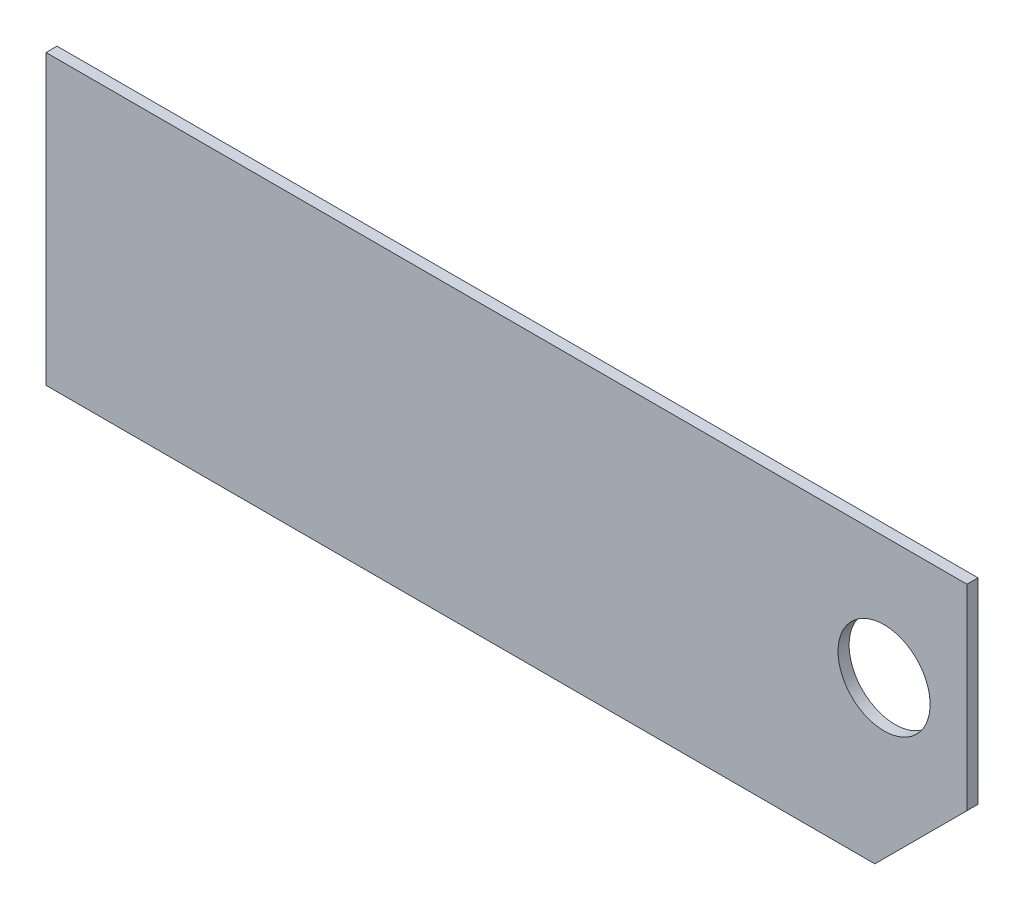
ISO-10303-21;
HEADER;
FILE_DESCRIPTION(('STEP AP214'),'2;1');
FILE_NAME('part.step','',(''),(''),'','','');
FILE_SCHEMA(('AUTOMOTIVE_DESIGN { 1 0 10303 214 1 1 1 1 }'));
ENDSEC;
DATA;
#1=APPLICATION_CONTEXT('core data for automotive mechanical design processes');
#2=APPLICATION_PROTOCOL_DEFINITION('international standard','automotive_design',2000,#1);
#3=PRODUCT_CONTEXT('',#1,'mechanical');
#4=PRODUCT('Part','Part','',(#3));
#5=PRODUCT_RELATED_PRODUCT_CATEGORY('part','',(#4));
#6=PRODUCT_DEFINITION_FORMATION('','',#4);
#7=PRODUCT_DEFINITION_CONTEXT('part definition',#1,'design');
#8=PRODUCT_DEFINITION('design','',#6,#7);
#9=PRODUCT_DEFINITION_SHAPE('','',#8);
#10=(LENGTH_UNIT() NAMED_UNIT(*) SI_UNIT(.MILLI.,.METRE.));
#11=(NAMED_UNIT(*) PLANE_ANGLE_UNIT() SI_UNIT($,.RADIAN.));
#12=(NAMED_UNIT(*) SI_UNIT($,.STERADIAN.) SOLID_ANGLE_UNIT());
#13=UNCERTAINTY_MEASURE_WITH_UNIT(LENGTH_MEASURE(1.E-05),#10,'distance_accuracy_value','');
#14=(GEOMETRIC_REPRESENTATION_CONTEXT(3) GLOBAL_UNCERTAINTY_ASSIGNED_CONTEXT((#13)) GLOBAL_UNIT_ASSIGNED_CONTEXT((#10,
#11,#12)) REPRESENTATION_CONTEXT('',''));
#15=CARTESIAN_POINT('',(0.,0.,0.));
#16=DIRECTION('',(0.,0.,1.));
#17=DIRECTION('',(1.,0.,0.));
#18=AXIS2_PLACEMENT_3D('',#15,#16,#17);
#19=CARTESIAN_POINT('',(-139.812818371494,47.1171062326941,0.75));
#20=DIRECTION('',(-1.,0.,0.));
#21=DIRECTION('',(0.,0.,1.));
#22=AXIS2_PLACEMENT_3D('',#19,#20,#21);
#23=PLANE('',#22);
#24=DIRECTION('',(0.,-1.,0.));
#25=VECTOR('',#24,1.);
#26=CARTESIAN_POINT('',(-139.812818371494,47.1171062326941,5.25));
#27=LINE('',#26,#25);
#28=CARTESIAN_POINT('',(-139.812818371494,47.1171062326941,5.25));
#29=VERTEX_POINT('',#28);
#30=CARTESIAN_POINT('',(-139.812818371494,-70.2578937673059,5.25));
#31=VERTEX_POINT('',#30);
#32=EDGE_CURVE('E112',#29,#31,#27,.T.);
#33=ORIENTED_EDGE('',*,*,#32,.F.);
#34=DIRECTION('',(0.,0.,1.));
#35=VECTOR('',#34,1.);
#36=CARTESIAN_POINT('',(-139.812818371494,47.1171062326941,0.75));
#37=LINE('',#36,#35);
#38=CARTESIAN_POINT('',(-139.812818371494,47.1171062326941,0.75));
#39=VERTEX_POINT('',#38);
#40=EDGE_CURVE('E11',#39,#29,#37,.T.);
#41=ORIENTED_EDGE('',*,*,#40,.F.);
#42=DIRECTION('',(0.,-1.,0.));
#43=VECTOR('',#42,1.);
#44=CARTESIAN_POINT('',(-139.812818371494,47.1171062326941,0.75));
#45=LINE('',#44,#43);
#46=CARTESIAN_POINT('',(-139.812818371494,-70.2578937673059,0.75));
#47=VERTEX_POINT('',#46);
#48=EDGE_CURVE('E107',#39,#47,#45,.T.);
#49=ORIENTED_EDGE('',*,*,#48,.T.);
#50=DIRECTION('',(0.,0.,1.));
#51=VECTOR('',#50,1.);
#52=CARTESIAN_POINT('',(-139.812818371494,-70.2578937673059,0.75));
#53=LINE('',#52,#51);
#54=EDGE_CURVE('E38',#47,#31,#53,.T.);
#55=ORIENTED_EDGE('',*,*,#54,.T.);
#56=EDGE_LOOP('',(#33,#41,#49,#55));
#57=FACE_BOUND('',#56,.T.);
#58=ADVANCED_FACE('F35',(#57),#23,.T.);
#59=CARTESIAN_POINT('',(235.187181628506,47.1171062326941,0.75));
#60=DIRECTION('',(0.,1.,0.));
#61=DIRECTION('',(0.,0.,1.));
#62=AXIS2_PLACEMENT_3D('',#59,#60,#61);
#63=PLANE('',#62);
#64=DIRECTION('',(-1.,0.,0.));
#65=VECTOR('',#64,1.);
#66=CARTESIAN_POINT('',(235.187181628506,47.1171062326941,5.25));
#67=LINE('',#66,#65);
#68=CARTESIAN_POINT('',(235.187181628506,47.1171062326941,5.25));
#69=VERTEX_POINT('',#68);
#70=EDGE_CURVE('E122',#69,#29,#67,.T.);
#71=ORIENTED_EDGE('',*,*,#70,.F.);
#72=DIRECTION('',(0.,0.,1.));
#73=VECTOR('',#72,1.);
#74=CARTESIAN_POINT('',(235.187181628506,47.1171062326941,0.75));
#75=LINE('',#74,#73);
#76=CARTESIAN_POINT('',(235.187181628506,47.1171062326941,0.75));
#77=VERTEX_POINT('',#76);
#78=EDGE_CURVE('E44',#77,#69,#75,.T.);
#79=ORIENTED_EDGE('',*,*,#78,.F.);
#80=DIRECTION('',(-1.,0.,0.));
#81=VECTOR('',#80,1.);
#82=CARTESIAN_POINT('',(235.187181628506,47.1171062326941,0.75));
#83=LINE('',#82,#81);
#84=EDGE_CURVE('E102',#77,#39,#83,.T.);
#85=ORIENTED_EDGE('',*,*,#84,.T.);
#86=ORIENTED_EDGE('',*,*,#40,.T.);
#87=EDGE_LOOP('',(#71,#79,#85,#86));
#88=FACE_BOUND('',#87,.T.);
#89=ADVANCED_FACE('F128',(#88),#63,.T.);
#90=CARTESIAN_POINT('',(235.187181628506,-32.7578937673059,0.75));
#91=DIRECTION('',(1.,0.,0.));
#92=DIRECTION('',(0.,0.,-1.));
#93=AXIS2_PLACEMENT_3D('',#90,#91,#92);
#94=PLANE('',#93);
#95=DIRECTION('',(0.,1.,0.));
#96=VECTOR('',#95,1.);
#97=CARTESIAN_POINT('',(235.187181628506,-32.7578937673059,5.25));
#98=LINE('',#97,#96);
#99=CARTESIAN_POINT('',(235.187181628506,-32.7578937673059,5.25));
#100=VERTEX_POINT('',#99);
#101=EDGE_CURVE('E91',#100,#69,#98,.T.);
#102=ORIENTED_EDGE('',*,*,#101,.F.);
#103=DIRECTION('',(0.,0.,1.));
#104=VECTOR('',#103,1.);
#105=CARTESIAN_POINT('',(235.187181628506,-32.7578937673059,0.75));
#106=LINE('',#105,#104);
#107=CARTESIAN_POINT('',(235.187181628506,-32.7578937673059,0.75));
#108=VERTEX_POINT('',#107);
#109=EDGE_CURVE('E86',#108,#100,#106,.T.);
#110=ORIENTED_EDGE('',*,*,#109,.F.);
#111=DIRECTION('',(0.,1.,0.));
#112=VECTOR('',#111,1.);
#113=CARTESIAN_POINT('',(235.187181628506,-32.7578937673059,0.75));
#114=LINE('',#113,#112);
#115=EDGE_CURVE('E89',#108,#77,#114,.T.);
#116=ORIENTED_EDGE('',*,*,#115,.T.);
#117=ORIENTED_EDGE('',*,*,#78,.T.);
#118=EDGE_LOOP('',(#102,#110,#116,#117));
#119=FACE_BOUND('',#118,.T.);
#120=ADVANCED_FACE('F88',(#119),#94,.T.);
#121=CARTESIAN_POINT('',(197.687181628506,-70.2578937673059,0.75));
#122=DIRECTION('',(0.707106781186548,-0.707106781186548,0.));
#123=DIRECTION('',(0.707106781186548,0.707106781186548,0.));
#124=AXIS2_PLACEMENT_3D('',#121,#122,#123);
#125=PLANE('',#124);
#126=DIRECTION('',(0.707106781186547,0.707106781186547,0.));
#127=VECTOR('',#126,1.);
#128=CARTESIAN_POINT('',(197.687181628506,-70.2578937673059,5.25));
#129=LINE('',#128,#127);
#130=CARTESIAN_POINT('',(197.687181628506,-70.2578937673059,5.25));
#131=VERTEX_POINT('',#130);
#132=EDGE_CURVE('E119',#131,#100,#129,.T.);
#133=ORIENTED_EDGE('',*,*,#132,.F.);
#134=DIRECTION('',(0.,0.,1.));
#135=VECTOR('',#134,1.);
#136=CARTESIAN_POINT('',(197.687181628506,-70.2578937673059,0.75));
#137=LINE('',#136,#135);
#138=CARTESIAN_POINT('',(197.687181628506,-70.2578937673059,0.75));
#139=VERTEX_POINT('',#138);
#140=EDGE_CURVE('E96',#139,#131,#137,.T.);
#141=ORIENTED_EDGE('',*,*,#140,.F.);
#142=DIRECTION('',(0.707106781186547,0.707106781186547,0.));
#143=VECTOR('',#142,1.);
#144=CARTESIAN_POINT('',(197.687181628506,-70.2578937673059,0.75));
#145=LINE('',#144,#143);
#146=EDGE_CURVE('E101',#139,#108,#145,.T.);
#147=ORIENTED_EDGE('',*,*,#146,.T.);
#148=ORIENTED_EDGE('',*,*,#109,.T.);
#149=EDGE_LOOP('',(#133,#141,#147,#148));
#150=FACE_BOUND('',#149,.T.);
#151=ADVANCED_FACE('F104',(#150),#125,.T.);
#152=CARTESIAN_POINT('',(-139.812818371494,-70.2578937673059,0.75));
#153=DIRECTION('',(0.,-1.,0.));
#154=DIRECTION('',(0.,0.,-1.));
#155=AXIS2_PLACEMENT_3D('',#152,#153,#154);
#156=PLANE('',#155);
#157=DIRECTION('',(1.,0.,0.));
#158=VECTOR('',#157,1.);
#159=CARTESIAN_POINT('',(-139.812818371494,-70.2578937673059,5.25));
#160=LINE('',#159,#158);
#161=EDGE_CURVE('E115',#31,#131,#160,.T.);
#162=ORIENTED_EDGE('',*,*,#161,.F.);
#163=ORIENTED_EDGE('',*,*,#54,.F.);
#164=DIRECTION('',(1.,0.,0.));
#165=VECTOR('',#164,1.);
#166=CARTESIAN_POINT('',(-139.812818371494,-70.2578937673059,0.75));
#167=LINE('',#166,#165);
#168=EDGE_CURVE('E105',#47,#139,#167,.T.);
#169=ORIENTED_EDGE('',*,*,#168,.T.);
#170=ORIENTED_EDGE('',*,*,#140,.T.);
#171=EDGE_LOOP('',(#162,#163,#169,#170));
#172=FACE_BOUND('',#171,.T.);
#173=ADVANCED_FACE('F125',(#172),#156,.T.);
#174=CARTESIAN_POINT('',(10.1871816285055,-2.75789376730586,0.75));
#175=DIRECTION('',(0.,0.,1.));
#176=DIRECTION('',(1.,0.,0.));
#177=AXIS2_PLACEMENT_3D('',#174,#175,#176);
#178=PLANE('',#177);
#179=CARTESIAN_POINT('',(201.437181628506,-2.75789376730586,0.75));
#180=DIRECTION('',(0.,0.,1.));
#181=DIRECTION('',(-1.,0.,0.));
#182=AXIS2_PLACEMENT_3D('',#179,#180,#181);
#183=CIRCLE('',#182,18.75);
#184=CARTESIAN_POINT('',(182.687181628506,-2.75789376730586,0.75));
#185=VERTEX_POINT('',#184);
#186=EDGE_CURVE('E116',#185,#185,#183,.T.);
#187=ORIENTED_EDGE('',*,*,#186,.T.);
#188=EDGE_LOOP('',(#187));
#189=FACE_BOUND('',#188,.T.);
#190=ORIENTED_EDGE('',*,*,#48,.F.);
#191=ORIENTED_EDGE('',*,*,#84,.F.);
#192=ORIENTED_EDGE('',*,*,#115,.F.);
#193=ORIENTED_EDGE('',*,*,#146,.F.);
#194=ORIENTED_EDGE('',*,*,#168,.F.);
#195=EDGE_LOOP('',(#190,#191,#192,#193,#194));
#196=FACE_BOUND('',#195,.T.);
#197=ADVANCED_FACE('F100',(#189,#196),#178,.F.);
#198=CARTESIAN_POINT('',(10.1871816285055,-2.75789376730586,5.25));
#199=DIRECTION('',(0.,0.,1.));
#200=DIRECTION('',(1.,0.,0.));
#201=AXIS2_PLACEMENT_3D('',#198,#199,#200);
#202=PLANE('',#201);
#203=CARTESIAN_POINT('',(201.437181628506,-2.75789376730586,5.25));
#204=DIRECTION('',(0.,0.,1.));
#205=DIRECTION('',(-1.,0.,0.));
#206=AXIS2_PLACEMENT_3D('',#203,#204,#205);
#207=CIRCLE('',#206,18.75);
#208=CARTESIAN_POINT('',(182.687181628506,-2.75789376730586,5.25));
#209=VERTEX_POINT('',#208);
#210=EDGE_CURVE('E160',#209,#209,#207,.T.);
#211=ORIENTED_EDGE('',*,*,#210,.F.);
#212=EDGE_LOOP('',(#211));
#213=FACE_BOUND('',#212,.T.);
#214=ORIENTED_EDGE('',*,*,#32,.T.);
#215=ORIENTED_EDGE('',*,*,#161,.T.);
#216=ORIENTED_EDGE('',*,*,#132,.T.);
#217=ORIENTED_EDGE('',*,*,#101,.T.);
#218=ORIENTED_EDGE('',*,*,#70,.T.);
#219=EDGE_LOOP('',(#214,#215,#216,#217,#218));
#220=FACE_BOUND('',#219,.T.);
#221=ADVANCED_FACE('F127',(#213,#220),#202,.T.);
#222=CARTESIAN_POINT('',(201.437181628506,-2.75789376730586,0.75));
#223=DIRECTION('',(0.,0.,1.));
#224=DIRECTION('',(1.,0.,0.));
#225=AXIS2_PLACEMENT_3D('',#222,#223,#224);
#226=CYLINDRICAL_SURFACE('',#225,18.75);
#227=ORIENTED_EDGE('',*,*,#186,.F.);
#228=EDGE_LOOP('',(#227));
#229=FACE_BOUND('',#228,.T.);
#230=ORIENTED_EDGE('',*,*,#210,.T.);
#231=EDGE_LOOP('',(#230));
#232=FACE_BOUND('',#231,.T.);
#233=ADVANCED_FACE('F148',(#229,#232),#226,.F.);
#234=CLOSED_SHELL('',(#58,#89,#120,#151,#173,#197,#221,#233));
#235=MANIFOLD_SOLID_BREP('B2',#234);
#236=ADVANCED_BREP_SHAPE_REPRESENTATION('',(#18,#235),#14);
#237=SHAPE_DEFINITION_REPRESENTATION(#9,#236);
ENDSEC;
END-ISO-10303-21;
